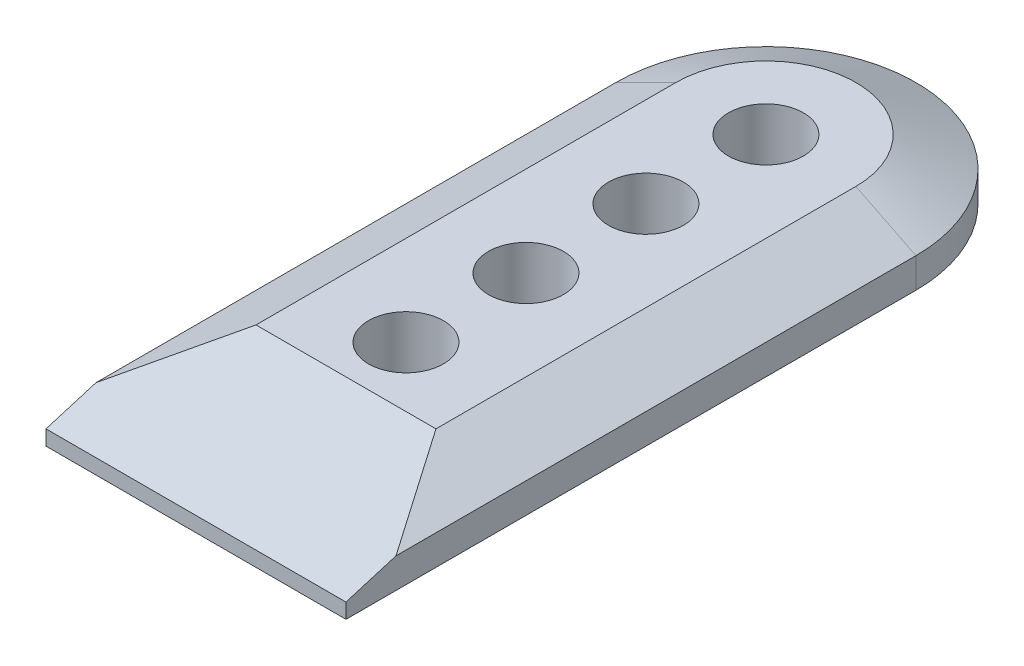
ISO-10303-21;
HEADER;
FILE_DESCRIPTION(('STEP AP214'),'2;1');
FILE_NAME('part.step','',(''),(''),'','','');
FILE_SCHEMA(('AUTOMOTIVE_DESIGN { 1 0 10303 214 1 1 1 1 }'));
ENDSEC;
DATA;
#1=APPLICATION_CONTEXT('core data for automotive mechanical design processes');
#2=APPLICATION_PROTOCOL_DEFINITION('international standard','automotive_design',2000,#1);
#3=PRODUCT_CONTEXT('',#1,'mechanical');
#4=PRODUCT('Part','Part','',(#3));
#5=PRODUCT_RELATED_PRODUCT_CATEGORY('part','',(#4));
#6=PRODUCT_DEFINITION_FORMATION('','',#4);
#7=PRODUCT_DEFINITION_CONTEXT('part definition',#1,'design');
#8=PRODUCT_DEFINITION('design','',#6,#7);
#9=PRODUCT_DEFINITION_SHAPE('','',#8);
#10=(LENGTH_UNIT() NAMED_UNIT(*) SI_UNIT(.MILLI.,.METRE.));
#11=(NAMED_UNIT(*) PLANE_ANGLE_UNIT() SI_UNIT($,.RADIAN.));
#12=(NAMED_UNIT(*) SI_UNIT($,.STERADIAN.) SOLID_ANGLE_UNIT());
#13=UNCERTAINTY_MEASURE_WITH_UNIT(LENGTH_MEASURE(1.E-05),#10,'distance_accuracy_value','');
#14=(GEOMETRIC_REPRESENTATION_CONTEXT(3) GLOBAL_UNCERTAINTY_ASSIGNED_CONTEXT((#13)) GLOBAL_UNIT_ASSIGNED_CONTEXT((#10,
#11,#12)) REPRESENTATION_CONTEXT('',''));
#15=CARTESIAN_POINT('',(0.,0.,0.));
#16=DIRECTION('',(0.,0.,1.));
#17=DIRECTION('',(1.,0.,0.));
#18=AXIS2_PLACEMENT_3D('',#15,#16,#17);
#19=CARTESIAN_POINT('',(-31.75,12.7,0.));
#20=DIRECTION('',(1.,0.,0.));
#21=DIRECTION('',(0.,0.,-1.));
#22=AXIS2_PLACEMENT_3D('',#19,#20,#21);
#23=PLANE('',#22);
#24=DIRECTION('',(0.,-1.,0.));
#25=VECTOR('',#24,1.);
#26=CARTESIAN_POINT('',(-31.75,12.7,0.));
#27=LINE('',#26,#25);
#28=CARTESIAN_POINT('',(-31.75,3.17499999999999,0.));
#29=VERTEX_POINT('',#28);
#30=CARTESIAN_POINT('',(-31.75,0.,0.));
#31=VERTEX_POINT('',#30);
#32=EDGE_CURVE('E89',#29,#31,#27,.T.);
#33=ORIENTED_EDGE('',*,*,#32,.F.);
#34=DIRECTION('',(0.,-0.287347885566343,0.957826285221152));
#35=VECTOR('',#34,1.);
#36=CARTESIAN_POINT('',(-31.75,12.7,-31.7500000000004));
#37=LINE('',#36,#35);
#38=CARTESIAN_POINT('',(-31.75,6.34999999999998,-10.5833333333334));
#39=VERTEX_POINT('',#38);
#40=EDGE_CURVE('E41',#29,#39,#37,.F.);
#41=ORIENTED_EDGE('',*,*,#40,.T.);
#42=DIRECTION('',(0.,0.,-1.));
#43=VECTOR('',#42,1.);
#44=CARTESIAN_POINT('',(-31.75,6.34999999999998,0.));
#45=LINE('',#44,#43);
#46=CARTESIAN_POINT('',(-31.75,6.34999999999998,-120.65));
#47=VERTEX_POINT('',#46);
#48=EDGE_CURVE('E136',#39,#47,#45,.T.);
#49=ORIENTED_EDGE('',*,*,#48,.T.);
#50=DIRECTION('',(0.,-1.,0.));
#51=VECTOR('',#50,1.);
#52=CARTESIAN_POINT('',(-31.75,12.7,-120.65));
#53=LINE('',#52,#51);
#54=CARTESIAN_POINT('',(-31.75,0.,-120.65));
#55=VERTEX_POINT('',#54);
#56=EDGE_CURVE('E107',#47,#55,#53,.T.);
#57=ORIENTED_EDGE('',*,*,#56,.T.);
#58=DIRECTION('',(0.,0.,1.));
#59=VECTOR('',#58,1.);
#60=CARTESIAN_POINT('',(-31.75,0.,0.));
#61=LINE('',#60,#59);
#62=EDGE_CURVE('E102',#55,#31,#61,.T.);
#63=ORIENTED_EDGE('',*,*,#62,.T.);
#64=EDGE_LOOP('',(#33,#41,#49,#57,#63));
#65=FACE_BOUND('',#64,.T.);
#66=ADVANCED_FACE('F33',(#65),#23,.F.);
#67=CARTESIAN_POINT('',(-31.75,12.7,0.));
#68=DIRECTION('',(0.,0.,-1.));
#69=DIRECTION('',(-1.,0.,0.));
#70=AXIS2_PLACEMENT_3D('',#67,#68,#69);
#71=PLANE('',#70);
#72=DIRECTION('',(0.,-1.,0.));
#73=VECTOR('',#72,1.);
#74=CARTESIAN_POINT('',(31.75,12.7,0.));
#75=LINE('',#74,#73);
#76=CARTESIAN_POINT('',(31.75,3.17499999999999,0.));
#77=VERTEX_POINT('',#76);
#78=CARTESIAN_POINT('',(31.75,0.,0.));
#79=VERTEX_POINT('',#78);
#80=EDGE_CURVE('E96',#77,#79,#75,.T.);
#81=ORIENTED_EDGE('',*,*,#80,.F.);
#82=DIRECTION('',(-1.,0.,0.));
#83=VECTOR('',#82,1.);
#84=CARTESIAN_POINT('',(-31.75,3.17499999999999,0.));
#85=LINE('',#84,#83);
#86=EDGE_CURVE('E55',#77,#29,#85,.T.);
#87=ORIENTED_EDGE('',*,*,#86,.T.);
#88=ORIENTED_EDGE('',*,*,#32,.T.);
#89=DIRECTION('',(1.,0.,0.));
#90=VECTOR('',#89,1.);
#91=CARTESIAN_POINT('',(-31.75,0.,0.));
#92=LINE('',#91,#90);
#93=EDGE_CURVE('E92',#31,#79,#92,.T.);
#94=ORIENTED_EDGE('',*,*,#93,.T.);
#95=EDGE_LOOP('',(#81,#87,#88,#94));
#96=FACE_BOUND('',#95,.T.);
#97=ADVANCED_FACE('F91',(#96),#71,.F.);
#98=CARTESIAN_POINT('',(31.75,12.7,0.));
#99=DIRECTION('',(-1.,0.,0.));
#100=DIRECTION('',(0.,0.,1.));
#101=AXIS2_PLACEMENT_3D('',#98,#99,#100);
#102=PLANE('',#101);
#103=DIRECTION('',(0.,0.,1.));
#104=VECTOR('',#103,1.);
#105=CARTESIAN_POINT('',(31.75,6.34999999999998,0.));
#106=LINE('',#105,#104);
#107=CARTESIAN_POINT('',(31.75,6.34999999999998,-120.65));
#108=VERTEX_POINT('',#107);
#109=CARTESIAN_POINT('',(31.75,6.34999999999998,-10.5833333333334));
#110=VERTEX_POINT('',#109);
#111=EDGE_CURVE('E131',#108,#110,#106,.T.);
#112=ORIENTED_EDGE('',*,*,#111,.T.);
#113=DIRECTION('',(0.,0.287347885566343,-0.957826285221152));
#114=VECTOR('',#113,1.);
#115=CARTESIAN_POINT('',(31.75,12.7,-31.7500000000004));
#116=LINE('',#115,#114);
#117=EDGE_CURVE('E146',#110,#77,#116,.F.);
#118=ORIENTED_EDGE('',*,*,#117,.T.);
#119=ORIENTED_EDGE('',*,*,#80,.T.);
#120=DIRECTION('',(0.,0.,-1.));
#121=VECTOR('',#120,1.);
#122=CARTESIAN_POINT('',(31.75,0.,0.));
#123=LINE('',#122,#121);
#124=CARTESIAN_POINT('',(31.75,0.,-120.65));
#125=VERTEX_POINT('',#124);
#126=EDGE_CURVE('E104',#79,#125,#123,.T.);
#127=ORIENTED_EDGE('',*,*,#126,.T.);
#128=DIRECTION('',(0.,-1.,0.));
#129=VECTOR('',#128,1.);
#130=CARTESIAN_POINT('',(31.75,12.7,-120.65));
#131=LINE('',#130,#129);
#132=EDGE_CURVE('E122',#108,#125,#131,.T.);
#133=ORIENTED_EDGE('',*,*,#132,.F.);
#134=EDGE_LOOP('',(#112,#118,#119,#127,#133));
#135=FACE_BOUND('',#134,.T.);
#136=ADVANCED_FACE('F150',(#135),#102,.F.);
#137=CARTESIAN_POINT('',(0.,12.7,-120.65));
#138=DIRECTION('',(0.,-1.,0.));
#139=DIRECTION('',(0.,0.,-1.));
#140=AXIS2_PLACEMENT_3D('',#137,#138,#139);
#141=CYLINDRICAL_SURFACE('',#140,31.75);
#142=ORIENTED_EDGE('',*,*,#56,.F.);
#143=CARTESIAN_POINT('',(0.,6.34999999999998,-120.65));
#144=DIRECTION('',(0.,-1.,0.));
#145=DIRECTION('',(0.,0.,-1.));
#146=AXIS2_PLACEMENT_3D('',#143,#144,#145);
#147=CIRCLE('',#146,31.75);
#148=EDGE_CURVE('E134',#47,#108,#147,.T.);
#149=ORIENTED_EDGE('',*,*,#148,.T.);
#150=ORIENTED_EDGE('',*,*,#132,.T.);
#151=CARTESIAN_POINT('',(0.,0.,-120.65));
#152=DIRECTION('',(0.,1.,0.));
#153=DIRECTION('',(0.,0.,-1.));
#154=AXIS2_PLACEMENT_3D('',#151,#152,#153);
#155=CIRCLE('',#154,31.75);
#156=EDGE_CURVE('E119',#125,#55,#155,.T.);
#157=ORIENTED_EDGE('',*,*,#156,.T.);
#158=EDGE_LOOP('',(#142,#149,#150,#157));
#159=FACE_BOUND('',#158,.T.);
#160=ADVANCED_FACE('F169',(#159),#141,.T.);
#161=CARTESIAN_POINT('',(0.,12.7,-120.65));
#162=DIRECTION('',(0.,-1.,0.));
#163=DIRECTION('',(0.,0.,-1.));
#164=AXIS2_PLACEMENT_3D('',#161,#162,#163);
#165=PLANE('',#164);
#166=CARTESIAN_POINT('',(0.,12.7,-120.65));
#167=DIRECTION('',(0.,1.,0.));
#168=DIRECTION('',(0.,0.,1.));
#169=AXIS2_PLACEMENT_3D('',#166,#167,#168);
#170=CIRCLE('',#169,7.9375);
#171=CARTESIAN_POINT('',(0.,12.7,-112.7125));
#172=VERTEX_POINT('',#171);
#173=EDGE_CURVE('E218',#172,#172,#170,.T.);
#174=ORIENTED_EDGE('',*,*,#173,.F.);
#175=EDGE_LOOP('',(#174));
#176=FACE_BOUND('',#175,.T.);
#177=CARTESIAN_POINT('',(2.66050878019847E-13,12.7,-95.25));
#178=DIRECTION('',(0.,1.,0.));
#179=DIRECTION('',(0.,0.,1.));
#180=AXIS2_PLACEMENT_3D('',#177,#178,#179);
#181=CIRCLE('',#180,7.93750000000001);
#182=CARTESIAN_POINT('',(2.66050878019847E-13,12.7,-87.3125));
#183=VERTEX_POINT('',#182);
#184=EDGE_CURVE('E223',#183,#183,#181,.T.);
#185=ORIENTED_EDGE('',*,*,#184,.F.);
#186=EDGE_LOOP('',(#185));
#187=FACE_BOUND('',#186,.T.);
#188=CARTESIAN_POINT('',(5.32101756039693E-13,12.7,-69.85));
#189=DIRECTION('',(0.,1.,0.));
#190=DIRECTION('',(0.,0.,1.));
#191=AXIS2_PLACEMENT_3D('',#188,#189,#190);
#192=CIRCLE('',#191,7.9375);
#193=CARTESIAN_POINT('',(5.32101756039693E-13,12.7,-61.9125));
#194=VERTEX_POINT('',#193);
#195=EDGE_CURVE('E231',#194,#194,#192,.T.);
#196=ORIENTED_EDGE('',*,*,#195,.F.);
#197=EDGE_LOOP('',(#196));
#198=FACE_BOUND('',#197,.T.);
#199=CARTESIAN_POINT('',(7.9815263405954E-13,12.7,-44.45));
#200=DIRECTION('',(0.,1.,0.));
#201=DIRECTION('',(0.,0.,1.));
#202=AXIS2_PLACEMENT_3D('',#199,#200,#201);
#203=CIRCLE('',#202,7.9375);
#204=CARTESIAN_POINT('',(7.9815263405954E-13,12.7,-36.5125));
#205=VERTEX_POINT('',#204);
#206=EDGE_CURVE('E115',#205,#205,#203,.T.);
#207=ORIENTED_EDGE('',*,*,#206,.F.);
#208=EDGE_LOOP('',(#207));
#209=FACE_BOUND('',#208,.T.);
#210=DIRECTION('',(0.,0.,1.));
#211=VECTOR('',#210,1.);
#212=CARTESIAN_POINT('',(-19.0499999999999,12.7,-120.65));
#213=LINE('',#212,#211);
#214=CARTESIAN_POINT('',(-19.0499999999999,12.7,-120.65));
#215=VERTEX_POINT('',#214);
#216=CARTESIAN_POINT('',(-19.0499999999999,12.7,-31.7500000000004));
#217=VERTEX_POINT('',#216);
#218=EDGE_CURVE('E95',#215,#217,#213,.T.);
#219=ORIENTED_EDGE('',*,*,#218,.T.);
#220=DIRECTION('',(1.,0.,0.));
#221=VECTOR('',#220,1.);
#222=CARTESIAN_POINT('',(0.,12.7,-31.7500000000004));
#223=LINE('',#222,#221);
#224=CARTESIAN_POINT('',(19.0499999999999,12.7,-31.7500000000004));
#225=VERTEX_POINT('',#224);
#226=EDGE_CURVE('E138',#217,#225,#223,.T.);
#227=ORIENTED_EDGE('',*,*,#226,.T.);
#228=DIRECTION('',(0.,0.,-1.));
#229=VECTOR('',#228,1.);
#230=CARTESIAN_POINT('',(19.0499999999999,12.7,-120.65));
#231=LINE('',#230,#229);
#232=CARTESIAN_POINT('',(19.0499999999999,12.7,-120.65));
#233=VERTEX_POINT('',#232);
#234=EDGE_CURVE('E129',#225,#233,#231,.T.);
#235=ORIENTED_EDGE('',*,*,#234,.T.);
#236=CARTESIAN_POINT('',(0.,12.7,-120.65));
#237=DIRECTION('',(0.,-1.,0.));
#238=DIRECTION('',(0.,0.,-1.));
#239=AXIS2_PLACEMENT_3D('',#236,#237,#238);
#240=CIRCLE('',#239,19.0499999999999);
#241=EDGE_CURVE('E127',#233,#215,#240,.F.);
#242=ORIENTED_EDGE('',*,*,#241,.T.);
#243=EDGE_LOOP('',(#219,#227,#235,#242));
#244=FACE_BOUND('',#243,.T.);
#245=ADVANCED_FACE('F161',(#176,#187,#198,#209,#244),#165,.F.);
#246=CARTESIAN_POINT('',(0.,0.,-120.65));
#247=DIRECTION('',(0.,-1.,0.));
#248=DIRECTION('',(0.,0.,-1.));
#249=AXIS2_PLACEMENT_3D('',#246,#247,#248);
#250=PLANE('',#249);
#251=CARTESIAN_POINT('',(0.,0.,-120.65));
#252=DIRECTION('',(0.,1.,0.));
#253=DIRECTION('',(0.,0.,1.));
#254=AXIS2_PLACEMENT_3D('',#251,#252,#253);
#255=CIRCLE('',#254,7.9375);
#256=CARTESIAN_POINT('',(0.,0.,-112.7125));
#257=VERTEX_POINT('',#256);
#258=EDGE_CURVE('E140',#257,#257,#255,.T.);
#259=ORIENTED_EDGE('',*,*,#258,.T.);
#260=EDGE_LOOP('',(#259));
#261=FACE_BOUND('',#260,.T.);
#262=CARTESIAN_POINT('',(2.66050878019847E-13,0.,-95.25));
#263=DIRECTION('',(0.,1.,0.));
#264=DIRECTION('',(0.,0.,1.));
#265=AXIS2_PLACEMENT_3D('',#262,#263,#264);
#266=CIRCLE('',#265,7.93750000000001);
#267=CARTESIAN_POINT('',(2.66050878019847E-13,0.,-87.3125));
#268=VERTEX_POINT('',#267);
#269=EDGE_CURVE('E219',#268,#268,#266,.T.);
#270=ORIENTED_EDGE('',*,*,#269,.T.);
#271=EDGE_LOOP('',(#270));
#272=FACE_BOUND('',#271,.T.);
#273=CARTESIAN_POINT('',(5.32101756039693E-13,0.,-69.85));
#274=DIRECTION('',(0.,1.,0.));
#275=DIRECTION('',(0.,0.,1.));
#276=AXIS2_PLACEMENT_3D('',#273,#274,#275);
#277=CIRCLE('',#276,7.9375);
#278=CARTESIAN_POINT('',(5.32101756039693E-13,0.,-61.9125));
#279=VERTEX_POINT('',#278);
#280=EDGE_CURVE('E228',#279,#279,#277,.T.);
#281=ORIENTED_EDGE('',*,*,#280,.T.);
#282=EDGE_LOOP('',(#281));
#283=FACE_BOUND('',#282,.T.);
#284=CARTESIAN_POINT('',(7.9815263405954E-13,0.,-44.45));
#285=DIRECTION('',(0.,1.,0.));
#286=DIRECTION('',(0.,0.,1.));
#287=AXIS2_PLACEMENT_3D('',#284,#285,#286);
#288=CIRCLE('',#287,7.9375);
#289=CARTESIAN_POINT('',(7.9815263405954E-13,0.,-36.5125));
#290=VERTEX_POINT('',#289);
#291=EDGE_CURVE('E233',#290,#290,#288,.T.);
#292=ORIENTED_EDGE('',*,*,#291,.T.);
#293=EDGE_LOOP('',(#292));
#294=FACE_BOUND('',#293,.T.);
#295=ORIENTED_EDGE('',*,*,#62,.F.);
#296=ORIENTED_EDGE('',*,*,#156,.F.);
#297=ORIENTED_EDGE('',*,*,#126,.F.);
#298=ORIENTED_EDGE('',*,*,#93,.F.);
#299=EDGE_LOOP('',(#295,#296,#297,#298));
#300=FACE_BOUND('',#299,.T.);
#301=ADVANCED_FACE('F100',(#261,#272,#283,#294,#300),#250,.T.);
#302=CARTESIAN_POINT('',(-19.0499999999999,12.7,-120.65));
#303=DIRECTION('',(0.447213595499956,-0.894427190999917,0.));
#304=DIRECTION('',(0.,0.,1.));
#305=AXIS2_PLACEMENT_3D('',#302,#303,#304);
#306=PLANE('',#305);
#307=ORIENTED_EDGE('',*,*,#48,.F.);
#308=DIRECTION('',(0.498272879122438,0.249136439561218,-0.830454798537401));
#309=VECTOR('',#308,1.);
#310=CARTESIAN_POINT('',(17.7362068965516,31.0931034482757,-93.0603448275866));
#311=LINE('',#310,#309);
#312=EDGE_CURVE('E11',#39,#217,#311,.T.);
#313=ORIENTED_EDGE('',*,*,#312,.T.);
#314=ORIENTED_EDGE('',*,*,#218,.F.);
#315=DIRECTION('',(0.894427190999917,0.447213595499956,0.));
#316=VECTOR('',#315,1.);
#317=CARTESIAN_POINT('',(-31.75,6.34999999999998,-120.65));
#318=LINE('',#317,#316);
#319=EDGE_CURVE('E109',#47,#215,#318,.T.);
#320=ORIENTED_EDGE('',*,*,#319,.F.);
#321=EDGE_LOOP('',(#307,#313,#314,#320));
#322=FACE_BOUND('',#321,.T.);
#323=ADVANCED_FACE('F158',(#322),#306,.F.);
#324=CARTESIAN_POINT('',(0.,12.7,-120.65));
#325=DIRECTION('',(0.,-1.,0.));
#326=DIRECTION('',(0.,0.,-1.));
#327=AXIS2_PLACEMENT_3D('',#324,#325,#326);
#328=CONICAL_SURFACE('',#327,19.0499999999999,1.10714871779409);
#329=ORIENTED_EDGE('',*,*,#319,.T.);
#330=ORIENTED_EDGE('',*,*,#241,.F.);
#331=DIRECTION('',(-0.894427190999917,0.447213595499956,0.));
#332=VECTOR('',#331,1.);
#333=CARTESIAN_POINT('',(31.75,6.34999999999998,-120.65));
#334=LINE('',#333,#332);
#335=EDGE_CURVE('E112',#108,#233,#334,.T.);
#336=ORIENTED_EDGE('',*,*,#335,.F.);
#337=ORIENTED_EDGE('',*,*,#148,.F.);
#338=EDGE_LOOP('',(#329,#330,#336,#337));
#339=FACE_BOUND('',#338,.T.);
#340=ADVANCED_FACE('F166',(#339),#328,.T.);
#341=CARTESIAN_POINT('',(19.0499999999999,12.7,-120.65));
#342=DIRECTION('',(-0.447213595499956,-0.894427190999917,0.));
#343=DIRECTION('',(0.,0.,-1.));
#344=AXIS2_PLACEMENT_3D('',#341,#342,#343);
#345=PLANE('',#344);
#346=ORIENTED_EDGE('',*,*,#234,.F.);
#347=DIRECTION('',(0.498272879122438,-0.249136439561218,0.830454798537401));
#348=VECTOR('',#347,1.);
#349=CARTESIAN_POINT('',(-17.7362068965516,31.0931034482757,-93.0603448275866));
#350=LINE('',#349,#348);
#351=EDGE_CURVE('E144',#225,#110,#350,.T.);
#352=ORIENTED_EDGE('',*,*,#351,.T.);
#353=ORIENTED_EDGE('',*,*,#111,.F.);
#354=ORIENTED_EDGE('',*,*,#335,.T.);
#355=EDGE_LOOP('',(#346,#352,#353,#354));
#356=FACE_BOUND('',#355,.T.);
#357=ADVANCED_FACE('F171',(#356),#345,.F.);
#358=CARTESIAN_POINT('',(0.,12.7,-31.7500000000004));
#359=DIRECTION('',(0.,-0.957826285221152,-0.287347885566343));
#360=DIRECTION('',(1.,0.,0.));
#361=AXIS2_PLACEMENT_3D('',#358,#359,#360);
#362=PLANE('',#361);
#363=ORIENTED_EDGE('',*,*,#40,.F.);
#364=ORIENTED_EDGE('',*,*,#86,.F.);
#365=ORIENTED_EDGE('',*,*,#117,.F.);
#366=ORIENTED_EDGE('',*,*,#351,.F.);
#367=ORIENTED_EDGE('',*,*,#226,.F.);
#368=ORIENTED_EDGE('',*,*,#312,.F.);
#369=EDGE_LOOP('',(#363,#364,#365,#366,#367,#368));
#370=FACE_BOUND('',#369,.T.);
#371=ADVANCED_FACE('F35',(#370),#362,.F.);
#372=CARTESIAN_POINT('',(7.9815263405954E-13,0.,-44.45));
#373=DIRECTION('',(0.,1.,0.));
#374=DIRECTION('',(0.,0.,1.));
#375=AXIS2_PLACEMENT_3D('',#372,#373,#374);
#376=CYLINDRICAL_SURFACE('',#375,7.9375);
#377=ORIENTED_EDGE('',*,*,#291,.F.);
#378=EDGE_LOOP('',(#377));
#379=FACE_BOUND('',#378,.T.);
#380=ORIENTED_EDGE('',*,*,#206,.T.);
#381=EDGE_LOOP('',(#380));
#382=FACE_BOUND('',#381,.T.);
#383=ADVANCED_FACE('F178',(#379,#382),#376,.F.);
#384=CARTESIAN_POINT('',(5.32101756039693E-13,0.,-69.85));
#385=DIRECTION('',(0.,1.,0.));
#386=DIRECTION('',(0.,0.,1.));
#387=AXIS2_PLACEMENT_3D('',#384,#385,#386);
#388=CYLINDRICAL_SURFACE('',#387,7.9375);
#389=ORIENTED_EDGE('',*,*,#280,.F.);
#390=EDGE_LOOP('',(#389));
#391=FACE_BOUND('',#390,.T.);
#392=ORIENTED_EDGE('',*,*,#195,.T.);
#393=EDGE_LOOP('',(#392));
#394=FACE_BOUND('',#393,.T.);
#395=ADVANCED_FACE('F199',(#391,#394),#388,.F.);
#396=CARTESIAN_POINT('',(2.66050878019847E-13,0.,-95.25));
#397=DIRECTION('',(0.,1.,0.));
#398=DIRECTION('',(0.,0.,1.));
#399=AXIS2_PLACEMENT_3D('',#396,#397,#398);
#400=CYLINDRICAL_SURFACE('',#399,7.93750000000001);
#401=ORIENTED_EDGE('',*,*,#269,.F.);
#402=EDGE_LOOP('',(#401));
#403=FACE_BOUND('',#402,.T.);
#404=ORIENTED_EDGE('',*,*,#184,.T.);
#405=EDGE_LOOP('',(#404));
#406=FACE_BOUND('',#405,.T.);
#407=ADVANCED_FACE('F203',(#403,#406),#400,.F.);
#408=CARTESIAN_POINT('',(0.,0.,-120.65));
#409=DIRECTION('',(0.,1.,0.));
#410=DIRECTION('',(0.,0.,1.));
#411=AXIS2_PLACEMENT_3D('',#408,#409,#410);
#412=CYLINDRICAL_SURFACE('',#411,7.9375);
#413=ORIENTED_EDGE('',*,*,#258,.F.);
#414=EDGE_LOOP('',(#413));
#415=FACE_BOUND('',#414,.T.);
#416=ORIENTED_EDGE('',*,*,#173,.T.);
#417=EDGE_LOOP('',(#416));
#418=FACE_BOUND('',#417,.T.);
#419=ADVANCED_FACE('F207',(#415,#418),#412,.F.);
#420=CLOSED_SHELL('',(#66,#97,#136,#160,#245,#301,#323,#340,#357,#371,#383,#395,#407,#419));
#421=MANIFOLD_SOLID_BREP('B2',#420);
#422=ADVANCED_BREP_SHAPE_REPRESENTATION('',(#18,#421),#14);
#423=SHAPE_DEFINITION_REPRESENTATION(#9,#422);
ENDSEC;
END-ISO-10303-21;
